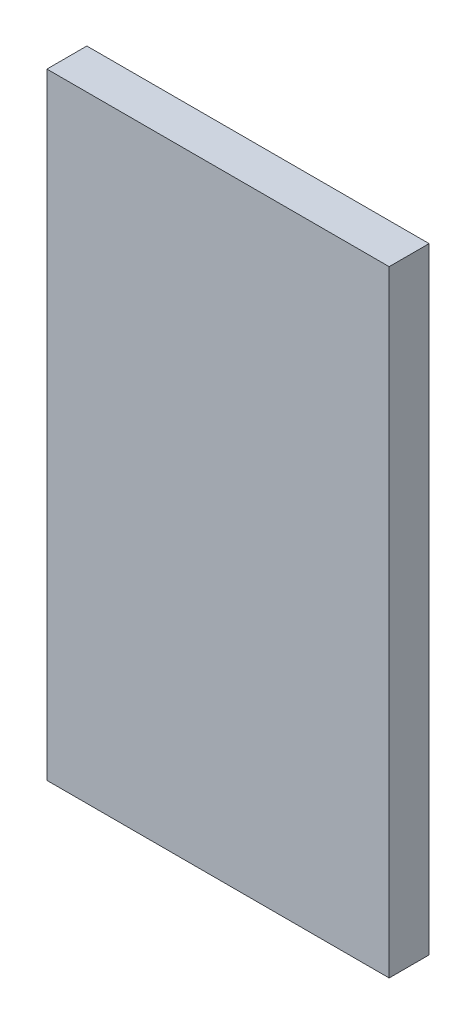
ISO-10303-21;
HEADER;
FILE_DESCRIPTION(('STEP AP214'),'2;1');
FILE_NAME('part.step','',(''),(''),'','','');
FILE_SCHEMA(('AUTOMOTIVE_DESIGN { 1 0 10303 214 1 1 1 1 }'));
ENDSEC;
DATA;
#1=APPLICATION_CONTEXT('core data for automotive mechanical design processes');
#2=APPLICATION_PROTOCOL_DEFINITION('international standard','automotive_design',2000,#1);
#3=PRODUCT_CONTEXT('',#1,'mechanical');
#4=PRODUCT('Part','Part','',(#3));
#5=PRODUCT_RELATED_PRODUCT_CATEGORY('part','',(#4));
#6=PRODUCT_DEFINITION_FORMATION('','',#4);
#7=PRODUCT_DEFINITION_CONTEXT('part definition',#1,'design');
#8=PRODUCT_DEFINITION('design','',#6,#7);
#9=PRODUCT_DEFINITION_SHAPE('','',#8);
#10=(LENGTH_UNIT() NAMED_UNIT(*) SI_UNIT(.MILLI.,.METRE.));
#11=(NAMED_UNIT(*) PLANE_ANGLE_UNIT() SI_UNIT($,.RADIAN.));
#12=(NAMED_UNIT(*) SI_UNIT($,.STERADIAN.) SOLID_ANGLE_UNIT());
#13=UNCERTAINTY_MEASURE_WITH_UNIT(LENGTH_MEASURE(1.E-05),#10,'distance_accuracy_value','');
#14=(GEOMETRIC_REPRESENTATION_CONTEXT(3) GLOBAL_UNCERTAINTY_ASSIGNED_CONTEXT((#13)) GLOBAL_UNIT_ASSIGNED_CONTEXT((#10,
#11,#12)) REPRESENTATION_CONTEXT('',''));
#15=CARTESIAN_POINT('',(0.,0.,0.));
#16=DIRECTION('',(0.,0.,1.));
#17=DIRECTION('',(1.,0.,0.));
#18=AXIS2_PLACEMENT_3D('',#15,#16,#17);
#19=CARTESIAN_POINT('',(190.5,-342.9,22.225));
#20=DIRECTION('',(-1.,0.,0.));
#21=DIRECTION('',(0.,0.,1.));
#22=AXIS2_PLACEMENT_3D('',#19,#20,#21);
#23=PLANE('',#22);
#24=DIRECTION('',(0.,1.,0.));
#25=VECTOR('',#24,1.);
#26=CARTESIAN_POINT('',(190.5,-342.9,-22.225));
#27=LINE('',#26,#25);
#28=CARTESIAN_POINT('',(190.5,-342.9,-22.225));
#29=VERTEX_POINT('',#28);
#30=CARTESIAN_POINT('',(190.5,342.9,-22.225));
#31=VERTEX_POINT('',#30);
#32=EDGE_CURVE('E96',#29,#31,#27,.T.);
#33=ORIENTED_EDGE('',*,*,#32,.T.);
#34=DIRECTION('',(0.,0.,-1.));
#35=VECTOR('',#34,1.);
#36=CARTESIAN_POINT('',(190.5,342.9,22.225));
#37=LINE('',#36,#35);
#38=CARTESIAN_POINT('',(190.5,342.9,22.225));
#39=VERTEX_POINT('',#38);
#40=EDGE_CURVE('E11',#39,#31,#37,.T.);
#41=ORIENTED_EDGE('',*,*,#40,.F.);
#42=DIRECTION('',(0.,1.,0.));
#43=VECTOR('',#42,1.);
#44=CARTESIAN_POINT('',(190.5,-342.9,22.225));
#45=LINE('',#44,#43);
#46=CARTESIAN_POINT('',(190.5,-342.9,22.225));
#47=VERTEX_POINT('',#46);
#48=EDGE_CURVE('E84',#47,#39,#45,.T.);
#49=ORIENTED_EDGE('',*,*,#48,.F.);
#50=DIRECTION('',(0.,0.,-1.));
#51=VECTOR('',#50,1.);
#52=CARTESIAN_POINT('',(190.5,-342.9,22.225));
#53=LINE('',#52,#51);
#54=EDGE_CURVE('E92',#47,#29,#53,.T.);
#55=ORIENTED_EDGE('',*,*,#54,.T.);
#56=EDGE_LOOP('',(#33,#41,#49,#55));
#57=FACE_BOUND('',#56,.T.);
#58=ADVANCED_FACE('F33',(#57),#23,.F.);
#59=CARTESIAN_POINT('',(-190.5,342.9,22.225));
#60=DIRECTION('',(0.,-1.,0.));
#61=DIRECTION('',(0.,0.,-1.));
#62=AXIS2_PLACEMENT_3D('',#59,#60,#61);
#63=PLANE('',#62);
#64=DIRECTION('',(-1.,0.,0.));
#65=VECTOR('',#64,1.);
#66=CARTESIAN_POINT('',(-190.5,342.9,-22.225));
#67=LINE('',#66,#65);
#68=CARTESIAN_POINT('',(-190.5,342.9,-22.225));
#69=VERTEX_POINT('',#68);
#70=EDGE_CURVE('E88',#31,#69,#67,.T.);
#71=ORIENTED_EDGE('',*,*,#70,.T.);
#72=DIRECTION('',(0.,0.,-1.));
#73=VECTOR('',#72,1.);
#74=CARTESIAN_POINT('',(-190.5,342.9,22.225));
#75=LINE('',#74,#73);
#76=CARTESIAN_POINT('',(-190.5,342.9,22.225));
#77=VERTEX_POINT('',#76);
#78=EDGE_CURVE('E41',#77,#69,#75,.T.);
#79=ORIENTED_EDGE('',*,*,#78,.F.);
#80=DIRECTION('',(-1.,0.,0.));
#81=VECTOR('',#80,1.);
#82=CARTESIAN_POINT('',(-190.5,342.9,22.225));
#83=LINE('',#82,#81);
#84=EDGE_CURVE('E79',#39,#77,#83,.T.);
#85=ORIENTED_EDGE('',*,*,#84,.F.);
#86=ORIENTED_EDGE('',*,*,#40,.T.);
#87=EDGE_LOOP('',(#71,#79,#85,#86));
#88=FACE_BOUND('',#87,.T.);
#89=ADVANCED_FACE('F87',(#88),#63,.F.);
#90=CARTESIAN_POINT('',(-190.5,-342.9,22.225));
#91=DIRECTION('',(1.,0.,0.));
#92=DIRECTION('',(0.,0.,-1.));
#93=AXIS2_PLACEMENT_3D('',#90,#91,#92);
#94=PLANE('',#93);
#95=DIRECTION('',(0.,-1.,0.));
#96=VECTOR('',#95,1.);
#97=CARTESIAN_POINT('',(-190.5,-342.9,-22.225));
#98=LINE('',#97,#96);
#99=CARTESIAN_POINT('',(-190.5,-342.9,-22.225));
#100=VERTEX_POINT('',#99);
#101=EDGE_CURVE('E66',#69,#100,#98,.T.);
#102=ORIENTED_EDGE('',*,*,#101,.T.);
#103=DIRECTION('',(0.,0.,-1.));
#104=VECTOR('',#103,1.);
#105=CARTESIAN_POINT('',(-190.5,-342.9,22.225));
#106=LINE('',#105,#104);
#107=CARTESIAN_POINT('',(-190.5,-342.9,22.225));
#108=VERTEX_POINT('',#107);
#109=EDGE_CURVE('E89',#108,#100,#106,.T.);
#110=ORIENTED_EDGE('',*,*,#109,.F.);
#111=DIRECTION('',(0.,-1.,0.));
#112=VECTOR('',#111,1.);
#113=CARTESIAN_POINT('',(-190.5,-342.9,22.225));
#114=LINE('',#113,#112);
#115=EDGE_CURVE('E82',#77,#108,#114,.T.);
#116=ORIENTED_EDGE('',*,*,#115,.F.);
#117=ORIENTED_EDGE('',*,*,#78,.T.);
#118=EDGE_LOOP('',(#102,#110,#116,#117));
#119=FACE_BOUND('',#118,.T.);
#120=ADVANCED_FACE('F90',(#119),#94,.F.);
#121=CARTESIAN_POINT('',(-190.5,-342.9,22.225));
#122=DIRECTION('',(0.,1.,0.));
#123=DIRECTION('',(0.,0.,1.));
#124=AXIS2_PLACEMENT_3D('',#121,#122,#123);
#125=PLANE('',#124);
#126=DIRECTION('',(1.,0.,0.));
#127=VECTOR('',#126,1.);
#128=CARTESIAN_POINT('',(-190.5,-342.9,-22.225));
#129=LINE('',#128,#127);
#130=EDGE_CURVE('E72',#100,#29,#129,.T.);
#131=ORIENTED_EDGE('',*,*,#130,.T.);
#132=ORIENTED_EDGE('',*,*,#54,.F.);
#133=DIRECTION('',(1.,0.,0.));
#134=VECTOR('',#133,1.);
#135=CARTESIAN_POINT('',(-190.5,-342.9,22.225));
#136=LINE('',#135,#134);
#137=EDGE_CURVE('E49',#108,#47,#136,.T.);
#138=ORIENTED_EDGE('',*,*,#137,.F.);
#139=ORIENTED_EDGE('',*,*,#109,.T.);
#140=EDGE_LOOP('',(#131,#132,#138,#139));
#141=FACE_BOUND('',#140,.T.);
#142=ADVANCED_FACE('F103',(#141),#125,.F.);
#143=CARTESIAN_POINT('',(0.,0.,22.225));
#144=DIRECTION('',(0.,0.,-1.));
#145=DIRECTION('',(-1.,0.,0.));
#146=AXIS2_PLACEMENT_3D('',#143,#144,#145);
#147=PLANE('',#146);
#148=ORIENTED_EDGE('',*,*,#48,.T.);
#149=ORIENTED_EDGE('',*,*,#84,.T.);
#150=ORIENTED_EDGE('',*,*,#115,.T.);
#151=ORIENTED_EDGE('',*,*,#137,.T.);
#152=EDGE_LOOP('',(#148,#149,#150,#151));
#153=FACE_BOUND('',#152,.T.);
#154=ADVANCED_FACE('F80',(#153),#147,.F.);
#155=CARTESIAN_POINT('',(0.,0.,-22.225));
#156=DIRECTION('',(0.,0.,-1.));
#157=DIRECTION('',(-1.,0.,0.));
#158=AXIS2_PLACEMENT_3D('',#155,#156,#157);
#159=PLANE('',#158);
#160=ORIENTED_EDGE('',*,*,#32,.F.);
#161=ORIENTED_EDGE('',*,*,#130,.F.);
#162=ORIENTED_EDGE('',*,*,#101,.F.);
#163=ORIENTED_EDGE('',*,*,#70,.F.);
#164=EDGE_LOOP('',(#160,#161,#162,#163));
#165=FACE_BOUND('',#164,.T.);
#166=ADVANCED_FACE('F106',(#165),#159,.T.);
#167=CLOSED_SHELL('',(#58,#89,#120,#142,#154,#166));
#168=MANIFOLD_SOLID_BREP('B2',#167);
#169=ADVANCED_BREP_SHAPE_REPRESENTATION('',(#18,#168),#14);
#170=SHAPE_DEFINITION_REPRESENTATION(#9,#169);
ENDSEC;
END-ISO-10303-21;
